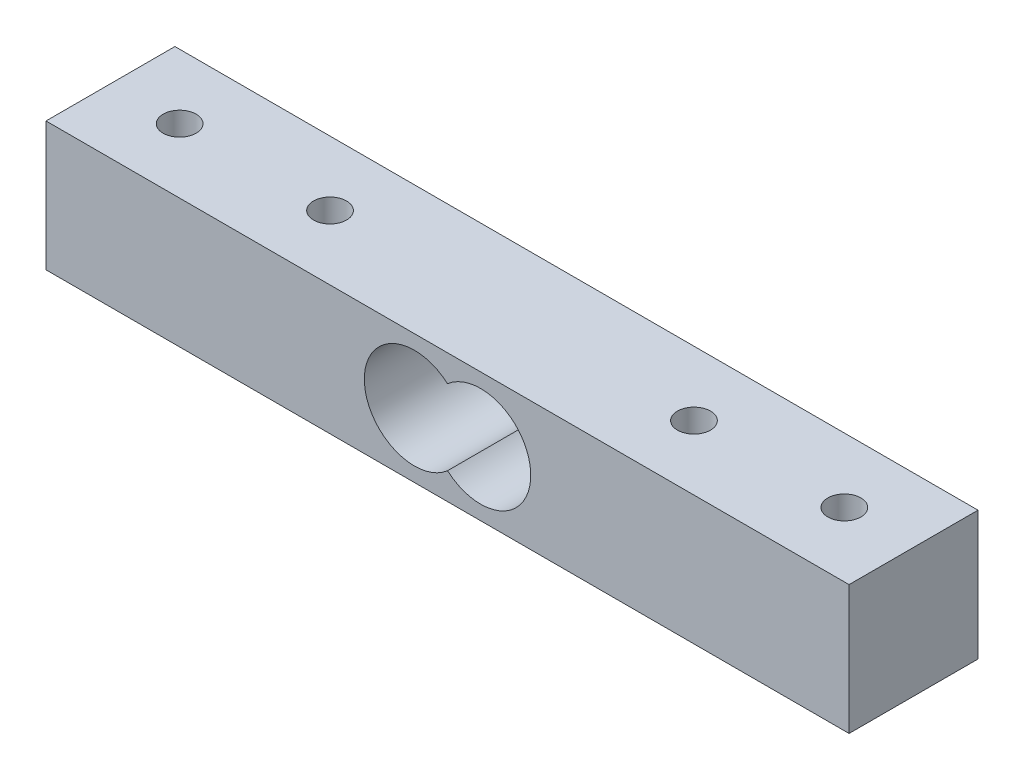
ISO-10303-21;
HEADER;
FILE_DESCRIPTION(('STEP AP214'),'2;1');
FILE_NAME('part.step','',(''),(''),'','','');
FILE_SCHEMA(('AUTOMOTIVE_DESIGN { 1 0 10303 214 1 1 1 1 }'));
ENDSEC;
DATA;
#1=APPLICATION_CONTEXT('core data for automotive mechanical design processes');
#2=APPLICATION_PROTOCOL_DEFINITION('international standard','automotive_design',2000,#1);
#3=PRODUCT_CONTEXT('',#1,'mechanical');
#4=PRODUCT('Part','Part','',(#3));
#5=PRODUCT_RELATED_PRODUCT_CATEGORY('part','',(#4));
#6=PRODUCT_DEFINITION_FORMATION('','',#4);
#7=PRODUCT_DEFINITION_CONTEXT('part definition',#1,'design');
#8=PRODUCT_DEFINITION('design','',#6,#7);
#9=PRODUCT_DEFINITION_SHAPE('','',#8);
#10=(LENGTH_UNIT() NAMED_UNIT(*) SI_UNIT(.MILLI.,.METRE.));
#11=(NAMED_UNIT(*) PLANE_ANGLE_UNIT() SI_UNIT($,.RADIAN.));
#12=(NAMED_UNIT(*) SI_UNIT($,.STERADIAN.) SOLID_ANGLE_UNIT());
#13=UNCERTAINTY_MEASURE_WITH_UNIT(LENGTH_MEASURE(1.E-05),#10,'distance_accuracy_value','');
#14=(GEOMETRIC_REPRESENTATION_CONTEXT(3) GLOBAL_UNCERTAINTY_ASSIGNED_CONTEXT((#13)) GLOBAL_UNIT_ASSIGNED_CONTEXT((#10,
#11,#12)) REPRESENTATION_CONTEXT('',''));
#15=CARTESIAN_POINT('',(0.,0.,0.));
#16=DIRECTION('',(0.,0.,1.));
#17=DIRECTION('',(1.,0.,0.));
#18=AXIS2_PLACEMENT_3D('',#15,#16,#17);
#19=CARTESIAN_POINT('',(0.,0.,6.43));
#20=DIRECTION('',(0.,0.,-1.));
#21=DIRECTION('',(-1.,0.,0.));
#22=AXIS2_PLACEMENT_3D('',#19,#20,#21);
#23=PLANE('',#22);
#24=DIRECTION('',(0.,1.,0.));
#25=VECTOR('',#24,1.);
#26=CARTESIAN_POINT('',(40.05,-6.43000000000003,6.43));
#27=LINE('',#26,#25);
#28=CARTESIAN_POINT('',(40.05,-6.43000000000003,6.43));
#29=VERTEX_POINT('',#28);
#30=CARTESIAN_POINT('',(40.05,6.42999999999997,6.43));
#31=VERTEX_POINT('',#30);
#32=EDGE_CURVE('E115',#29,#31,#27,.T.);
#33=ORIENTED_EDGE('',*,*,#32,.T.);
#34=DIRECTION('',(-1.,0.,0.));
#35=VECTOR('',#34,1.);
#36=CARTESIAN_POINT('',(-40.05,6.43000000000002,6.43));
#37=LINE('',#36,#35);
#38=CARTESIAN_POINT('',(-40.05,6.43000000000002,6.43));
#39=VERTEX_POINT('',#38);
#40=EDGE_CURVE('E118',#31,#39,#37,.T.);
#41=ORIENTED_EDGE('',*,*,#40,.T.);
#42=DIRECTION('',(0.,-1.,0.));
#43=VECTOR('',#42,1.);
#44=CARTESIAN_POINT('',(-40.05,-6.43000000000004,6.43));
#45=LINE('',#44,#43);
#46=CARTESIAN_POINT('',(-40.05,-6.43000000000004,6.43));
#47=VERTEX_POINT('',#46);
#48=EDGE_CURVE('E121',#39,#47,#45,.T.);
#49=ORIENTED_EDGE('',*,*,#48,.T.);
#50=DIRECTION('',(1.,0.,0.));
#51=VECTOR('',#50,1.);
#52=CARTESIAN_POINT('',(-40.05,-6.43000000000004,6.43));
#53=LINE('',#52,#51);
#54=EDGE_CURVE('E123',#47,#29,#53,.T.);
#55=ORIENTED_EDGE('',*,*,#54,.T.);
#56=EDGE_LOOP('',(#33,#41,#49,#55));
#57=FACE_BOUND('',#56,.T.);
#58=CARTESIAN_POINT('',(3.3,0.,6.43));
#59=DIRECTION('',(0.,0.,1.));
#60=DIRECTION('',(-1.,0.,0.));
#61=AXIS2_PLACEMENT_3D('',#58,#59,#60);
#62=CIRCLE('',#61,5.);
#63=CARTESIAN_POINT('',(0.,-3.75632799419859,6.43));
#64=VERTEX_POINT('',#63);
#65=CARTESIAN_POINT('',(0.,3.75632799419859,6.43));
#66=VERTEX_POINT('',#65);
#67=EDGE_CURVE('E101',#64,#66,#62,.T.);
#68=ORIENTED_EDGE('',*,*,#67,.F.);
#69=CARTESIAN_POINT('',(-3.3,0.,6.43));
#70=DIRECTION('',(0.,0.,1.));
#71=DIRECTION('',(1.,0.,0.));
#72=AXIS2_PLACEMENT_3D('',#69,#70,#71);
#73=CIRCLE('',#72,5.);
#74=EDGE_CURVE('E95',#66,#64,#73,.T.);
#75=ORIENTED_EDGE('',*,*,#74,.F.);
#76=EDGE_LOOP('',(#68,#75));
#77=FACE_BOUND('',#76,.T.);
#78=ADVANCED_FACE('F43',(#57,#77),#23,.F.);
#79=CARTESIAN_POINT('',(0.,0.,-6.43));
#80=DIRECTION('',(0.,0.,-1.));
#81=DIRECTION('',(-1.,0.,0.));
#82=AXIS2_PLACEMENT_3D('',#79,#80,#81);
#83=PLANE('',#82);
#84=DIRECTION('',(0.,1.,0.));
#85=VECTOR('',#84,1.);
#86=CARTESIAN_POINT('',(40.05,-6.43000000000003,-6.43));
#87=LINE('',#86,#85);
#88=CARTESIAN_POINT('',(40.05,-6.43000000000003,-6.43));
#89=VERTEX_POINT('',#88);
#90=CARTESIAN_POINT('',(40.05,6.42999999999997,-6.43));
#91=VERTEX_POINT('',#90);
#92=EDGE_CURVE('E114',#89,#91,#87,.T.);
#93=ORIENTED_EDGE('',*,*,#92,.F.);
#94=DIRECTION('',(1.,0.,0.));
#95=VECTOR('',#94,1.);
#96=CARTESIAN_POINT('',(-40.05,-6.43000000000004,-6.43));
#97=LINE('',#96,#95);
#98=CARTESIAN_POINT('',(-40.05,-6.43000000000004,-6.43));
#99=VERTEX_POINT('',#98);
#100=EDGE_CURVE('E119',#99,#89,#97,.T.);
#101=ORIENTED_EDGE('',*,*,#100,.F.);
#102=DIRECTION('',(0.,-1.,0.));
#103=VECTOR('',#102,1.);
#104=CARTESIAN_POINT('',(-40.05,-6.43000000000004,-6.43));
#105=LINE('',#104,#103);
#106=CARTESIAN_POINT('',(-40.05,6.43000000000002,-6.43));
#107=VERTEX_POINT('',#106);
#108=EDGE_CURVE('E130',#107,#99,#105,.T.);
#109=ORIENTED_EDGE('',*,*,#108,.F.);
#110=DIRECTION('',(-1.,0.,0.));
#111=VECTOR('',#110,1.);
#112=CARTESIAN_POINT('',(-40.05,6.43000000000002,-6.43));
#113=LINE('',#112,#111);
#114=EDGE_CURVE('E128',#91,#107,#113,.T.);
#115=ORIENTED_EDGE('',*,*,#114,.F.);
#116=EDGE_LOOP('',(#93,#101,#109,#115));
#117=FACE_BOUND('',#116,.T.);
#118=CARTESIAN_POINT('',(-3.3,0.,-6.43));
#119=DIRECTION('',(0.,0.,1.));
#120=DIRECTION('',(1.,0.,0.));
#121=AXIS2_PLACEMENT_3D('',#118,#119,#120);
#122=CIRCLE('',#121,5.);
#123=CARTESIAN_POINT('',(0.,3.75632799419859,-6.43));
#124=VERTEX_POINT('',#123);
#125=CARTESIAN_POINT('',(0.,-3.75632799419859,-6.43));
#126=VERTEX_POINT('',#125);
#127=EDGE_CURVE('E105',#124,#126,#122,.T.);
#128=ORIENTED_EDGE('',*,*,#127,.T.);
#129=CARTESIAN_POINT('',(3.3,0.,-6.43));
#130=DIRECTION('',(0.,0.,1.));
#131=DIRECTION('',(-1.,0.,0.));
#132=AXIS2_PLACEMENT_3D('',#129,#130,#131);
#133=CIRCLE('',#132,5.);
#134=EDGE_CURVE('E65',#126,#124,#133,.T.);
#135=ORIENTED_EDGE('',*,*,#134,.T.);
#136=EDGE_LOOP('',(#128,#135));
#137=FACE_BOUND('',#136,.T.);
#138=ADVANCED_FACE('F148',(#117,#137),#83,.T.);
#139=CARTESIAN_POINT('',(40.05,-6.43000000000003,6.43));
#140=DIRECTION('',(-1.,0.,0.));
#141=DIRECTION('',(0.,0.,1.));
#142=AXIS2_PLACEMENT_3D('',#139,#140,#141);
#143=PLANE('',#142);
#144=ORIENTED_EDGE('',*,*,#92,.T.);
#145=DIRECTION('',(0.,0.,-1.));
#146=VECTOR('',#145,1.);
#147=CARTESIAN_POINT('',(40.05,6.42999999999997,6.43));
#148=LINE('',#147,#146);
#149=EDGE_CURVE('E11',#31,#91,#148,.T.);
#150=ORIENTED_EDGE('',*,*,#149,.F.);
#151=ORIENTED_EDGE('',*,*,#32,.F.);
#152=DIRECTION('',(0.,0.,-1.));
#153=VECTOR('',#152,1.);
#154=CARTESIAN_POINT('',(40.05,-6.43000000000003,6.43));
#155=LINE('',#154,#153);
#156=EDGE_CURVE('E125',#29,#89,#155,.T.);
#157=ORIENTED_EDGE('',*,*,#156,.T.);
#158=EDGE_LOOP('',(#144,#150,#151,#157));
#159=FACE_BOUND('',#158,.T.);
#160=ADVANCED_FACE('F45',(#159),#143,.F.);
#161=CARTESIAN_POINT('',(-40.05,6.43000000000002,6.43));
#162=DIRECTION('',(0.,-1.,0.));
#163=DIRECTION('',(1.,0.,0.));
#164=AXIS2_PLACEMENT_3D('',#161,#162,#163);
#165=PLANE('',#164);
#166=CARTESIAN_POINT('',(-33.15,6.43000000000002,0.));
#167=DIRECTION('',(0.,1.,0.));
#168=DIRECTION('',(0.,0.,1.));
#169=AXIS2_PLACEMENT_3D('',#166,#167,#168);
#170=CIRCLE('',#169,1.65);
#171=CARTESIAN_POINT('',(-33.15,6.43000000000002,1.65000000000001));
#172=VERTEX_POINT('',#171);
#173=EDGE_CURVE('E219',#172,#172,#170,.T.);
#174=ORIENTED_EDGE('',*,*,#173,.F.);
#175=EDGE_LOOP('',(#174));
#176=FACE_BOUND('',#175,.T.);
#177=CARTESIAN_POINT('',(-18.15,6.43000000000001,0.));
#178=DIRECTION('',(0.,1.,0.));
#179=DIRECTION('',(0.,0.,1.));
#180=AXIS2_PLACEMENT_3D('',#177,#178,#179);
#181=CIRCLE('',#180,1.65);
#182=CARTESIAN_POINT('',(-18.15,6.43000000000001,1.65000000000001));
#183=VERTEX_POINT('',#182);
#184=EDGE_CURVE('E212',#183,#183,#181,.T.);
#185=ORIENTED_EDGE('',*,*,#184,.F.);
#186=EDGE_LOOP('',(#185));
#187=FACE_BOUND('',#186,.T.);
#188=CARTESIAN_POINT('',(18.15,6.42999999999999,0.));
#189=DIRECTION('',(0.,1.,0.));
#190=DIRECTION('',(0.,0.,1.));
#191=AXIS2_PLACEMENT_3D('',#188,#189,#190);
#192=CIRCLE('',#191,1.65);
#193=CARTESIAN_POINT('',(18.15,6.42999999999999,1.65));
#194=VERTEX_POINT('',#193);
#195=EDGE_CURVE('E203',#194,#194,#192,.T.);
#196=ORIENTED_EDGE('',*,*,#195,.F.);
#197=EDGE_LOOP('',(#196));
#198=FACE_BOUND('',#197,.T.);
#199=CARTESIAN_POINT('',(33.15,6.42999999999998,0.));
#200=DIRECTION('',(0.,1.,0.));
#201=DIRECTION('',(0.,0.,1.));
#202=AXIS2_PLACEMENT_3D('',#199,#200,#201);
#203=CIRCLE('',#202,1.65);
#204=CARTESIAN_POINT('',(33.15,6.42999999999998,1.65));
#205=VERTEX_POINT('',#204);
#206=EDGE_CURVE('E198',#205,#205,#203,.T.);
#207=ORIENTED_EDGE('',*,*,#206,.F.);
#208=EDGE_LOOP('',(#207));
#209=FACE_BOUND('',#208,.T.);
#210=ORIENTED_EDGE('',*,*,#114,.T.);
#211=DIRECTION('',(0.,0.,-1.));
#212=VECTOR('',#211,1.);
#213=CARTESIAN_POINT('',(-40.05,6.43000000000002,6.43));
#214=LINE('',#213,#212);
#215=EDGE_CURVE('E51',#39,#107,#214,.T.);
#216=ORIENTED_EDGE('',*,*,#215,.F.);
#217=ORIENTED_EDGE('',*,*,#40,.F.);
#218=ORIENTED_EDGE('',*,*,#149,.T.);
#219=EDGE_LOOP('',(#210,#216,#217,#218));
#220=FACE_BOUND('',#219,.T.);
#221=ADVANCED_FACE('F158',(#176,#187,#198,#209,#220),#165,.F.);
#222=CARTESIAN_POINT('',(-40.05,-6.43000000000004,6.43));
#223=DIRECTION('',(1.,0.,0.));
#224=DIRECTION('',(0.,0.,-1.));
#225=AXIS2_PLACEMENT_3D('',#222,#223,#224);
#226=PLANE('',#225);
#227=ORIENTED_EDGE('',*,*,#108,.T.);
#228=DIRECTION('',(0.,0.,-1.));
#229=VECTOR('',#228,1.);
#230=CARTESIAN_POINT('',(-40.05,-6.43000000000004,6.43));
#231=LINE('',#230,#229);
#232=EDGE_CURVE('E135',#47,#99,#231,.T.);
#233=ORIENTED_EDGE('',*,*,#232,.F.);
#234=ORIENTED_EDGE('',*,*,#48,.F.);
#235=ORIENTED_EDGE('',*,*,#215,.T.);
#236=EDGE_LOOP('',(#227,#233,#234,#235));
#237=FACE_BOUND('',#236,.T.);
#238=ADVANCED_FACE('F142',(#237),#226,.F.);
#239=CARTESIAN_POINT('',(-40.05,-6.43000000000004,6.43));
#240=DIRECTION('',(0.,1.,0.));
#241=DIRECTION('',(-1.,0.,0.));
#242=AXIS2_PLACEMENT_3D('',#239,#240,#241);
#243=PLANE('',#242);
#244=CARTESIAN_POINT('',(-33.15,-6.43000000000004,0.));
#245=DIRECTION('',(0.,1.,0.));
#246=DIRECTION('',(0.,0.,1.));
#247=AXIS2_PLACEMENT_3D('',#244,#245,#246);
#248=CIRCLE('',#247,2.025);
#249=CARTESIAN_POINT('',(-33.15,-6.43000000000004,2.025));
#250=VERTEX_POINT('',#249);
#251=EDGE_CURVE('E185',#250,#250,#248,.T.);
#252=ORIENTED_EDGE('',*,*,#251,.T.);
#253=EDGE_LOOP('',(#252));
#254=FACE_BOUND('',#253,.T.);
#255=CARTESIAN_POINT('',(-18.15,-6.43000000000005,0.));
#256=DIRECTION('',(0.,1.,0.));
#257=DIRECTION('',(0.,0.,1.));
#258=AXIS2_PLACEMENT_3D('',#255,#256,#257);
#259=CIRCLE('',#258,2.025);
#260=CARTESIAN_POINT('',(-18.15,-6.43000000000005,2.025));
#261=VERTEX_POINT('',#260);
#262=EDGE_CURVE('E189',#261,#261,#259,.T.);
#263=ORIENTED_EDGE('',*,*,#262,.T.);
#264=EDGE_LOOP('',(#263));
#265=FACE_BOUND('',#264,.T.);
#266=CARTESIAN_POINT('',(18.15,-6.43000000000007,0.));
#267=DIRECTION('',(0.,1.,0.));
#268=DIRECTION('',(0.,0.,1.));
#269=AXIS2_PLACEMENT_3D('',#266,#267,#268);
#270=CIRCLE('',#269,2.025);
#271=CARTESIAN_POINT('',(18.15,-6.43000000000007,2.025));
#272=VERTEX_POINT('',#271);
#273=EDGE_CURVE('E193',#272,#272,#270,.T.);
#274=ORIENTED_EDGE('',*,*,#273,.T.);
#275=EDGE_LOOP('',(#274));
#276=FACE_BOUND('',#275,.T.);
#277=CARTESIAN_POINT('',(33.15,-6.43000000000008,0.));
#278=DIRECTION('',(0.,1.,0.));
#279=DIRECTION('',(0.,0.,1.));
#280=AXIS2_PLACEMENT_3D('',#277,#278,#279);
#281=CIRCLE('',#280,2.025);
#282=CARTESIAN_POINT('',(33.15,-6.43000000000008,2.025));
#283=VERTEX_POINT('',#282);
#284=EDGE_CURVE('E196',#283,#283,#281,.T.);
#285=ORIENTED_EDGE('',*,*,#284,.T.);
#286=EDGE_LOOP('',(#285));
#287=FACE_BOUND('',#286,.T.);
#288=ORIENTED_EDGE('',*,*,#100,.T.);
#289=ORIENTED_EDGE('',*,*,#156,.F.);
#290=ORIENTED_EDGE('',*,*,#54,.F.);
#291=ORIENTED_EDGE('',*,*,#232,.T.);
#292=EDGE_LOOP('',(#288,#289,#290,#291));
#293=FACE_BOUND('',#292,.T.);
#294=ADVANCED_FACE('F152',(#254,#265,#276,#287,#293),#243,.F.);
#295=CARTESIAN_POINT('',(3.3,0.,6.43));
#296=DIRECTION('',(0.,0.,-1.));
#297=DIRECTION('',(-1.,0.,0.));
#298=AXIS2_PLACEMENT_3D('',#295,#296,#297);
#299=CYLINDRICAL_SURFACE('',#298,5.);
#300=ORIENTED_EDGE('',*,*,#134,.F.);
#301=DIRECTION('',(0.,0.,-1.));
#302=VECTOR('',#301,1.);
#303=CARTESIAN_POINT('',(0.,-3.75632799419859,6.43));
#304=LINE('',#303,#302);
#305=EDGE_CURVE('E97',#64,#126,#304,.T.);
#306=ORIENTED_EDGE('',*,*,#305,.F.);
#307=ORIENTED_EDGE('',*,*,#67,.T.);
#308=DIRECTION('',(0.,0.,-1.));
#309=VECTOR('',#308,1.);
#310=CARTESIAN_POINT('',(0.,3.75632799419859,6.43));
#311=LINE('',#310,#309);
#312=EDGE_CURVE('E58',#66,#124,#311,.T.);
#313=ORIENTED_EDGE('',*,*,#312,.T.);
#314=EDGE_LOOP('',(#300,#306,#307,#313));
#315=FACE_BOUND('',#314,.T.);
#316=ADVANCED_FACE('F103',(#315),#299,.F.);
#317=CARTESIAN_POINT('',(-3.3,0.,6.43));
#318=DIRECTION('',(0.,0.,-1.));
#319=DIRECTION('',(-1.,0.,0.));
#320=AXIS2_PLACEMENT_3D('',#317,#318,#319);
#321=CYLINDRICAL_SURFACE('',#320,5.);
#322=ORIENTED_EDGE('',*,*,#127,.F.);
#323=ORIENTED_EDGE('',*,*,#312,.F.);
#324=ORIENTED_EDGE('',*,*,#74,.T.);
#325=ORIENTED_EDGE('',*,*,#305,.T.);
#326=EDGE_LOOP('',(#322,#323,#324,#325));
#327=FACE_BOUND('',#326,.T.);
#328=ADVANCED_FACE('F96',(#327),#321,.F.);
#329=CARTESIAN_POINT('',(33.15,-6.05500000000008,0.));
#330=DIRECTION('',(0.,-1.,0.));
#331=DIRECTION('',(0.,0.,-1.));
#332=AXIS2_PLACEMENT_3D('',#329,#330,#331);
#333=CONICAL_SURFACE('',#332,1.65,0.785398163397451);
#334=ORIENTED_EDGE('',*,*,#284,.F.);
#335=EDGE_LOOP('',(#334));
#336=FACE_BOUND('',#335,.T.);
#337=CARTESIAN_POINT('',(33.15,-6.05500000000008,0.));
#338=DIRECTION('',(0.,1.,0.));
#339=DIRECTION('',(0.,0.,1.));
#340=AXIS2_PLACEMENT_3D('',#337,#338,#339);
#341=CIRCLE('',#340,1.65);
#342=CARTESIAN_POINT('',(33.15,-6.05500000000008,1.65));
#343=VERTEX_POINT('',#342);
#344=EDGE_CURVE('E109',#343,#343,#341,.T.);
#345=ORIENTED_EDGE('',*,*,#344,.T.);
#346=EDGE_LOOP('',(#345));
#347=FACE_BOUND('',#346,.T.);
#348=ADVANCED_FACE('F254',(#336,#347),#333,.F.);
#349=CARTESIAN_POINT('',(33.15,6.42999999999998,0.));
#350=DIRECTION('',(0.,1.,0.));
#351=DIRECTION('',(0.,0.,1.));
#352=AXIS2_PLACEMENT_3D('',#349,#350,#351);
#353=CYLINDRICAL_SURFACE('',#352,1.65);
#354=ORIENTED_EDGE('',*,*,#344,.F.);
#355=EDGE_LOOP('',(#354));
#356=FACE_BOUND('',#355,.T.);
#357=ORIENTED_EDGE('',*,*,#206,.T.);
#358=EDGE_LOOP('',(#357));
#359=FACE_BOUND('',#358,.T.);
#360=ADVANCED_FACE('F250',(#356,#359),#353,.F.);
#361=CARTESIAN_POINT('',(18.15,-6.05500000000007,0.));
#362=DIRECTION('',(0.,-1.,0.));
#363=DIRECTION('',(0.,0.,-1.));
#364=AXIS2_PLACEMENT_3D('',#361,#362,#363);
#365=CONICAL_SURFACE('',#364,1.65,0.785398163397451);
#366=ORIENTED_EDGE('',*,*,#273,.F.);
#367=EDGE_LOOP('',(#366));
#368=FACE_BOUND('',#367,.T.);
#369=CARTESIAN_POINT('',(18.15,-6.05500000000007,0.));
#370=DIRECTION('',(0.,1.,0.));
#371=DIRECTION('',(0.,0.,1.));
#372=AXIS2_PLACEMENT_3D('',#369,#370,#371);
#373=CIRCLE('',#372,1.65);
#374=CARTESIAN_POINT('',(18.15,-6.05500000000007,1.65));
#375=VERTEX_POINT('',#374);
#376=EDGE_CURVE('E199',#375,#375,#373,.T.);
#377=ORIENTED_EDGE('',*,*,#376,.T.);
#378=EDGE_LOOP('',(#377));
#379=FACE_BOUND('',#378,.T.);
#380=ADVANCED_FACE('F246',(#368,#379),#365,.F.);
#381=CARTESIAN_POINT('',(18.15,6.42999999999999,0.));
#382=DIRECTION('',(0.,1.,0.));
#383=DIRECTION('',(0.,0.,1.));
#384=AXIS2_PLACEMENT_3D('',#381,#382,#383);
#385=CYLINDRICAL_SURFACE('',#384,1.65);
#386=ORIENTED_EDGE('',*,*,#376,.F.);
#387=EDGE_LOOP('',(#386));
#388=FACE_BOUND('',#387,.T.);
#389=ORIENTED_EDGE('',*,*,#195,.T.);
#390=EDGE_LOOP('',(#389));
#391=FACE_BOUND('',#390,.T.);
#392=ADVANCED_FACE('F242',(#388,#391),#385,.F.);
#393=CARTESIAN_POINT('',(-18.15,-6.05500000000005,0.));
#394=DIRECTION('',(0.,-1.,0.));
#395=DIRECTION('',(0.,0.,-1.));
#396=AXIS2_PLACEMENT_3D('',#393,#394,#395);
#397=CONICAL_SURFACE('',#396,1.65,0.785398163397451);
#398=ORIENTED_EDGE('',*,*,#262,.F.);
#399=EDGE_LOOP('',(#398));
#400=FACE_BOUND('',#399,.T.);
#401=CARTESIAN_POINT('',(-18.15,-6.05500000000005,0.));
#402=DIRECTION('',(0.,1.,0.));
#403=DIRECTION('',(0.,0.,1.));
#404=AXIS2_PLACEMENT_3D('',#401,#402,#403);
#405=CIRCLE('',#404,1.65);
#406=CARTESIAN_POINT('',(-18.15,-6.05500000000005,1.65));
#407=VERTEX_POINT('',#406);
#408=EDGE_CURVE('E209',#407,#407,#405,.T.);
#409=ORIENTED_EDGE('',*,*,#408,.T.);
#410=EDGE_LOOP('',(#409));
#411=FACE_BOUND('',#410,.T.);
#412=ADVANCED_FACE('F238',(#400,#411),#397,.F.);
#413=CARTESIAN_POINT('',(-18.15,6.43000000000001,0.));
#414=DIRECTION('',(0.,1.,0.));
#415=DIRECTION('',(0.,0.,1.));
#416=AXIS2_PLACEMENT_3D('',#413,#414,#415);
#417=CYLINDRICAL_SURFACE('',#416,1.65);
#418=ORIENTED_EDGE('',*,*,#408,.F.);
#419=EDGE_LOOP('',(#418));
#420=FACE_BOUND('',#419,.T.);
#421=ORIENTED_EDGE('',*,*,#184,.T.);
#422=EDGE_LOOP('',(#421));
#423=FACE_BOUND('',#422,.T.);
#424=ADVANCED_FACE('F231',(#420,#423),#417,.F.);
#425=CARTESIAN_POINT('',(-33.15,-6.05500000000004,0.));
#426=DIRECTION('',(0.,-1.,0.));
#427=DIRECTION('',(0.,0.,-1.));
#428=AXIS2_PLACEMENT_3D('',#425,#426,#427);
#429=CONICAL_SURFACE('',#428,1.65,0.785398163397446);
#430=ORIENTED_EDGE('',*,*,#251,.F.);
#431=EDGE_LOOP('',(#430));
#432=FACE_BOUND('',#431,.T.);
#433=CARTESIAN_POINT('',(-33.15,-6.05500000000004,0.));
#434=DIRECTION('',(0.,1.,0.));
#435=DIRECTION('',(0.,0.,1.));
#436=AXIS2_PLACEMENT_3D('',#433,#434,#435);
#437=CIRCLE('',#436,1.65);
#438=CARTESIAN_POINT('',(-33.15,-6.05500000000004,1.65000000000001));
#439=VERTEX_POINT('',#438);
#440=EDGE_CURVE('E216',#439,#439,#437,.T.);
#441=ORIENTED_EDGE('',*,*,#440,.T.);
#442=EDGE_LOOP('',(#441));
#443=FACE_BOUND('',#442,.T.);
#444=ADVANCED_FACE('F225',(#432,#443),#429,.F.);
#445=CARTESIAN_POINT('',(-33.15,6.43000000000002,0.));
#446=DIRECTION('',(0.,1.,0.));
#447=DIRECTION('',(0.,0.,1.));
#448=AXIS2_PLACEMENT_3D('',#445,#446,#447);
#449=CYLINDRICAL_SURFACE('',#448,1.65);
#450=ORIENTED_EDGE('',*,*,#440,.F.);
#451=EDGE_LOOP('',(#450));
#452=FACE_BOUND('',#451,.T.);
#453=ORIENTED_EDGE('',*,*,#173,.T.);
#454=EDGE_LOOP('',(#453));
#455=FACE_BOUND('',#454,.T.);
#456=ADVANCED_FACE('F223',(#452,#455),#449,.F.);
#457=CLOSED_SHELL('',(#78,#138,#160,#221,#238,#294,#316,#328,#348,#360,#380,#392,#412,#424,#444,#456));
#458=MANIFOLD_SOLID_BREP('B2',#457);
#459=ADVANCED_BREP_SHAPE_REPRESENTATION('',(#18,#458),#14);
#460=SHAPE_DEFINITION_REPRESENTATION(#9,#459);
ENDSEC;
END-ISO-10303-21;
